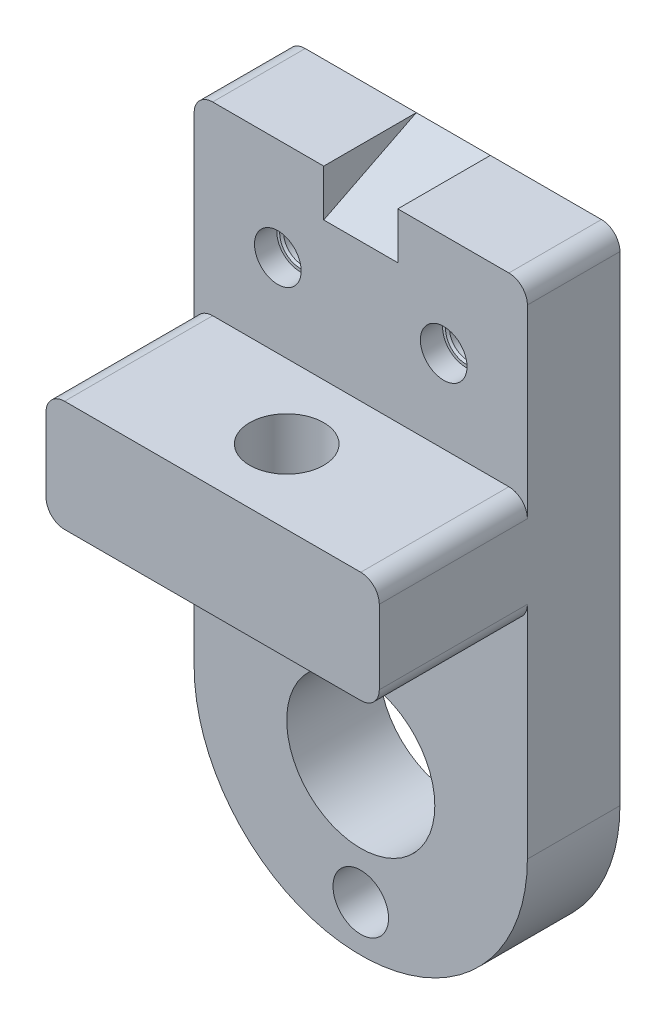
ISO-10303-21;
HEADER;
FILE_DESCRIPTION(('STEP AP214'),'2;1');
FILE_NAME('part.step','',(''),(''),'','','');
FILE_SCHEMA(('AUTOMOTIVE_DESIGN { 1 0 10303 214 1 1 1 1 }'));
ENDSEC;
DATA;
#1=APPLICATION_CONTEXT('core data for automotive mechanical design processes');
#2=APPLICATION_PROTOCOL_DEFINITION('international standard','automotive_design',2000,#1);
#3=PRODUCT_CONTEXT('',#1,'mechanical');
#4=PRODUCT('Part','Part','',(#3));
#5=PRODUCT_RELATED_PRODUCT_CATEGORY('part','',(#4));
#6=PRODUCT_DEFINITION_FORMATION('','',#4);
#7=PRODUCT_DEFINITION_CONTEXT('part definition',#1,'design');
#8=PRODUCT_DEFINITION('design','',#6,#7);
#9=PRODUCT_DEFINITION_SHAPE('','',#8);
#10=(LENGTH_UNIT() NAMED_UNIT(*) SI_UNIT(.MILLI.,.METRE.));
#11=(NAMED_UNIT(*) PLANE_ANGLE_UNIT() SI_UNIT($,.RADIAN.));
#12=(NAMED_UNIT(*) SI_UNIT($,.STERADIAN.) SOLID_ANGLE_UNIT());
#13=UNCERTAINTY_MEASURE_WITH_UNIT(LENGTH_MEASURE(1.E-05),#10,'distance_accuracy_value','');
#14=(GEOMETRIC_REPRESENTATION_CONTEXT(3) GLOBAL_UNCERTAINTY_ASSIGNED_CONTEXT((#13)) GLOBAL_UNIT_ASSIGNED_CONTEXT((#10,
#11,#12)) REPRESENTATION_CONTEXT('',''));
#15=CARTESIAN_POINT('',(0.,0.,0.));
#16=DIRECTION('',(0.,0.,1.));
#17=DIRECTION('',(1.,0.,0.));
#18=AXIS2_PLACEMENT_3D('',#15,#16,#17);
#19=CARTESIAN_POINT('',(12.7,0.,31.75));
#20=DIRECTION('',(1.,0.,0.));
#21=DIRECTION('',(0.,1.,0.));
#22=AXIS2_PLACEMENT_3D('',#19,#20,#21);
#23=PLANE('',#22);
#24=DIRECTION('',(0.,0.450068893368779,-0.892993836049165));
#25=VECTOR('',#24,1.);
#26=CARTESIAN_POINT('',(12.7,154.94,31.75));
#27=LINE('',#26,#25);
#28=CARTESIAN_POINT('',(12.7,154.94,31.75));
#29=VERTEX_POINT('',#28);
#30=CARTESIAN_POINT('',(12.7,170.942,0.));
#31=VERTEX_POINT('',#30);
#32=EDGE_CURVE('E163',#29,#31,#27,.T.);
#33=ORIENTED_EDGE('',*,*,#32,.F.);
#34=DIRECTION('',(0.,-1.,0.));
#35=VECTOR('',#34,1.);
#36=CARTESIAN_POINT('',(12.7,0.,31.75));
#37=LINE('',#36,#35);
#38=CARTESIAN_POINT('',(12.7,170.942,31.75));
#39=VERTEX_POINT('',#38);
#40=EDGE_CURVE('E173',#39,#29,#37,.T.);
#41=ORIENTED_EDGE('',*,*,#40,.F.);
#42=DIRECTION('',(0.,0.,-1.));
#43=VECTOR('',#42,1.);
#44=CARTESIAN_POINT('',(12.7,170.942,31.75));
#45=LINE('',#44,#43);
#46=EDGE_CURVE('E178',#39,#31,#45,.T.);
#47=ORIENTED_EDGE('',*,*,#46,.T.);
#48=EDGE_LOOP('',(#33,#41,#47));
#49=FACE_BOUND('',#48,.T.);
#50=ADVANCED_FACE('F41',(#49),#23,.F.);
#51=CARTESIAN_POINT('',(-12.7,0.,31.75));
#52=DIRECTION('',(1.,0.,0.));
#53=DIRECTION('',(0.,0.,-1.));
#54=AXIS2_PLACEMENT_3D('',#51,#52,#53);
#55=PLANE('',#54);
#56=DIRECTION('',(0.,-1.,0.));
#57=VECTOR('',#56,1.);
#58=CARTESIAN_POINT('',(-12.7,0.,31.75));
#59=LINE('',#58,#57);
#60=CARTESIAN_POINT('',(-12.7,170.942,31.75));
#61=VERTEX_POINT('',#60);
#62=CARTESIAN_POINT('',(-12.7,154.94,31.75));
#63=VERTEX_POINT('',#62);
#64=EDGE_CURVE('E172',#61,#63,#59,.T.);
#65=ORIENTED_EDGE('',*,*,#64,.T.);
#66=DIRECTION('',(0.,-0.450068893368779,0.892993836049165));
#67=VECTOR('',#66,1.);
#68=CARTESIAN_POINT('',(-12.7,154.94,31.75));
#69=LINE('',#68,#67);
#70=CARTESIAN_POINT('',(-12.7,170.942,0.));
#71=VERTEX_POINT('',#70);
#72=EDGE_CURVE('E166',#71,#63,#69,.T.);
#73=ORIENTED_EDGE('',*,*,#72,.F.);
#74=DIRECTION('',(0.,0.,-1.));
#75=VECTOR('',#74,1.);
#76=CARTESIAN_POINT('',(-12.7,170.942,31.75));
#77=LINE('',#76,#75);
#78=EDGE_CURVE('E197',#61,#71,#77,.T.);
#79=ORIENTED_EDGE('',*,*,#78,.F.);
#80=EDGE_LOOP('',(#65,#73,#79));
#81=FACE_BOUND('',#80,.T.);
#82=ADVANCED_FACE('F410',(#81),#55,.T.);
#83=CARTESIAN_POINT('',(0.,170.942,31.75));
#84=DIRECTION('',(0.,1.,0.));
#85=DIRECTION('',(0.,0.,1.));
#86=AXIS2_PLACEMENT_3D('',#83,#84,#85);
#87=PLANE('',#86);
#88=DIRECTION('',(1.,0.,0.));
#89=VECTOR('',#88,1.);
#90=CARTESIAN_POINT('',(0.,170.942,0.));
#91=LINE('',#90,#89);
#92=CARTESIAN_POINT('',(-50.8,170.942,0.));
#93=VERTEX_POINT('',#92);
#94=EDGE_CURVE('E198',#93,#71,#91,.T.);
#95=ORIENTED_EDGE('',*,*,#94,.F.);
#96=DIRECTION('',(0.,0.,-1.));
#97=VECTOR('',#96,1.);
#98=CARTESIAN_POINT('',(-50.8,170.942,31.75));
#99=LINE('',#98,#97);
#100=CARTESIAN_POINT('',(-50.8,170.942,31.75));
#101=VERTEX_POINT('',#100);
#102=EDGE_CURVE('E11',#101,#93,#99,.T.);
#103=ORIENTED_EDGE('',*,*,#102,.F.);
#104=DIRECTION('',(1.,0.,0.));
#105=VECTOR('',#104,1.);
#106=CARTESIAN_POINT('',(0.,170.942,31.75));
#107=LINE('',#106,#105);
#108=EDGE_CURVE('E220',#101,#61,#107,.T.);
#109=ORIENTED_EDGE('',*,*,#108,.T.);
#110=ORIENTED_EDGE('',*,*,#78,.T.);
#111=EDGE_LOOP('',(#95,#103,#109,#110));
#112=FACE_BOUND('',#111,.T.);
#113=ADVANCED_FACE('F43',(#112),#87,.T.);
#114=CARTESIAN_POINT('',(-50.8,164.592,31.75));
#115=DIRECTION('',(0.,0.,-1.));
#116=DIRECTION('',(-1.,0.,0.));
#117=AXIS2_PLACEMENT_3D('',#114,#115,#116);
#118=CYLINDRICAL_SURFACE('',#117,6.35);
#119=CARTESIAN_POINT('',(-50.8,164.592,0.));
#120=DIRECTION('',(0.,0.,1.));
#121=DIRECTION('',(1.,0.,0.));
#122=AXIS2_PLACEMENT_3D('',#119,#120,#121);
#123=CIRCLE('',#122,6.35);
#124=CARTESIAN_POINT('',(-57.15,164.592,0.));
#125=VERTEX_POINT('',#124);
#126=EDGE_CURVE('E202',#93,#125,#123,.T.);
#127=ORIENTED_EDGE('',*,*,#126,.T.);
#128=DIRECTION('',(0.,0.,-1.));
#129=VECTOR('',#128,1.);
#130=CARTESIAN_POINT('',(-57.15,164.592,31.75));
#131=LINE('',#130,#129);
#132=CARTESIAN_POINT('',(-57.15,164.592,31.75));
#133=VERTEX_POINT('',#132);
#134=EDGE_CURVE('E51',#133,#125,#131,.T.);
#135=ORIENTED_EDGE('',*,*,#134,.F.);
#136=CARTESIAN_POINT('',(-50.8,164.592,31.75));
#137=DIRECTION('',(0.,0.,1.));
#138=DIRECTION('',(1.,0.,0.));
#139=AXIS2_PLACEMENT_3D('',#136,#137,#138);
#140=CIRCLE('',#139,6.35);
#141=EDGE_CURVE('E338',#101,#133,#140,.T.);
#142=ORIENTED_EDGE('',*,*,#141,.F.);
#143=ORIENTED_EDGE('',*,*,#102,.T.);
#144=EDGE_LOOP('',(#127,#135,#142,#143));
#145=FACE_BOUND('',#144,.T.);
#146=ADVANCED_FACE('F428',(#145),#118,.T.);
#147=CARTESIAN_POINT('',(-57.15,0.,31.75));
#148=DIRECTION('',(1.,0.,0.));
#149=DIRECTION('',(0.,1.,0.));
#150=AXIS2_PLACEMENT_3D('',#147,#148,#149);
#151=PLANE('',#150);
#152=DIRECTION('',(0.,-1.,0.));
#153=VECTOR('',#152,1.);
#154=CARTESIAN_POINT('',(-57.15,0.,0.));
#155=LINE('',#154,#153);
#156=CARTESIAN_POINT('',(-57.15,0.,0.));
#157=VERTEX_POINT('',#156);
#158=EDGE_CURVE('E206',#125,#157,#155,.T.);
#159=ORIENTED_EDGE('',*,*,#158,.T.);
#160=DIRECTION('',(0.,0.,-1.));
#161=VECTOR('',#160,1.);
#162=CARTESIAN_POINT('',(-57.15,0.,31.75));
#163=LINE('',#162,#161);
#164=CARTESIAN_POINT('',(-57.15,0.,31.75));
#165=VERTEX_POINT('',#164);
#166=EDGE_CURVE('E277',#165,#157,#163,.T.);
#167=ORIENTED_EDGE('',*,*,#166,.F.);
#168=DIRECTION('',(0.,-1.,0.));
#169=VECTOR('',#168,1.);
#170=CARTESIAN_POINT('',(-57.15,0.,31.75));
#171=LINE('',#170,#169);
#172=CARTESIAN_POINT('',(-57.15,75.6920000000001,31.75));
#173=VERTEX_POINT('',#172);
#174=EDGE_CURVE('E374',#173,#165,#171,.T.);
#175=ORIENTED_EDGE('',*,*,#174,.F.);
#176=DIRECTION('',(0.,0.,-1.));
#177=VECTOR('',#176,1.);
#178=CARTESIAN_POINT('',(-57.15,75.6920000000001,82.55));
#179=LINE('',#178,#177);
#180=CARTESIAN_POINT('',(-57.15,75.6920000000001,82.55));
#181=VERTEX_POINT('',#180);
#182=EDGE_CURVE('E58',#181,#173,#179,.T.);
#183=ORIENTED_EDGE('',*,*,#182,.F.);
#184=DIRECTION('',(0.,-1.,0.));
#185=VECTOR('',#184,1.);
#186=CARTESIAN_POINT('',(-57.15,0.,82.55));
#187=LINE('',#186,#185);
#188=CARTESIAN_POINT('',(-57.15,101.092,82.55));
#189=VERTEX_POINT('',#188);
#190=EDGE_CURVE('E292',#189,#181,#187,.T.);
#191=ORIENTED_EDGE('',*,*,#190,.F.);
#192=DIRECTION('',(0.,0.,-1.));
#193=VECTOR('',#192,1.);
#194=CARTESIAN_POINT('',(-57.15,101.092,82.55));
#195=LINE('',#194,#193);
#196=CARTESIAN_POINT('',(-57.15,101.092,31.75));
#197=VERTEX_POINT('',#196);
#198=EDGE_CURVE('E325',#189,#197,#195,.T.);
#199=ORIENTED_EDGE('',*,*,#198,.T.);
#200=DIRECTION('',(0.,-1.,0.));
#201=VECTOR('',#200,1.);
#202=CARTESIAN_POINT('',(-57.15,0.,31.75));
#203=LINE('',#202,#201);
#204=EDGE_CURVE('E242',#133,#197,#203,.T.);
#205=ORIENTED_EDGE('',*,*,#204,.F.);
#206=ORIENTED_EDGE('',*,*,#134,.T.);
#207=EDGE_LOOP('',(#159,#167,#175,#183,#191,#199,#205,#206));
#208=FACE_BOUND('',#207,.T.);
#209=ADVANCED_FACE('F238',(#208),#151,.F.);
#210=CARTESIAN_POINT('',(57.15,0.,31.75));
#211=DIRECTION('',(1.,0.,0.));
#212=DIRECTION('',(0.,1.,0.));
#213=AXIS2_PLACEMENT_3D('',#210,#211,#212);
#214=PLANE('',#213);
#215=DIRECTION('',(0.,-1.,0.));
#216=VECTOR('',#215,1.);
#217=CARTESIAN_POINT('',(57.15,0.,0.));
#218=LINE('',#217,#216);
#219=CARTESIAN_POINT('',(57.15,164.592,0.));
#220=VERTEX_POINT('',#219);
#221=CARTESIAN_POINT('',(57.15,0.,0.));
#222=VERTEX_POINT('',#221);
#223=EDGE_CURVE('E209',#220,#222,#218,.T.);
#224=ORIENTED_EDGE('',*,*,#223,.F.);
#225=DIRECTION('',(0.,0.,-1.));
#226=VECTOR('',#225,1.);
#227=CARTESIAN_POINT('',(57.15,164.592,31.75));
#228=LINE('',#227,#226);
#229=CARTESIAN_POINT('',(57.15,164.592,31.75));
#230=VERTEX_POINT('',#229);
#231=EDGE_CURVE('E229',#230,#220,#228,.T.);
#232=ORIENTED_EDGE('',*,*,#231,.F.);
#233=DIRECTION('',(0.,-1.,0.));
#234=VECTOR('',#233,1.);
#235=CARTESIAN_POINT('',(57.15,0.,31.75));
#236=LINE('',#235,#234);
#237=CARTESIAN_POINT('',(57.15,101.092,31.75));
#238=VERTEX_POINT('',#237);
#239=EDGE_CURVE('E352',#230,#238,#236,.T.);
#240=ORIENTED_EDGE('',*,*,#239,.T.);
#241=DIRECTION('',(0.,0.,-1.));
#242=VECTOR('',#241,1.);
#243=CARTESIAN_POINT('',(57.15,101.092,82.55));
#244=LINE('',#243,#242);
#245=CARTESIAN_POINT('',(57.15,101.092,82.55));
#246=VERTEX_POINT('',#245);
#247=EDGE_CURVE('E308',#246,#238,#244,.T.);
#248=ORIENTED_EDGE('',*,*,#247,.F.);
#249=DIRECTION('',(0.,-1.,0.));
#250=VECTOR('',#249,1.);
#251=CARTESIAN_POINT('',(57.15,0.,82.55));
#252=LINE('',#251,#250);
#253=CARTESIAN_POINT('',(57.15,75.6920000000001,82.55));
#254=VERTEX_POINT('',#253);
#255=EDGE_CURVE('E304',#246,#254,#252,.T.);
#256=ORIENTED_EDGE('',*,*,#255,.T.);
#257=DIRECTION('',(0.,0.,-1.));
#258=VECTOR('',#257,1.);
#259=CARTESIAN_POINT('',(57.15,75.6920000000001,82.55));
#260=LINE('',#259,#258);
#261=CARTESIAN_POINT('',(57.15,75.6920000000001,31.75));
#262=VERTEX_POINT('',#261);
#263=EDGE_CURVE('E312',#254,#262,#260,.T.);
#264=ORIENTED_EDGE('',*,*,#263,.T.);
#265=DIRECTION('',(0.,-1.,0.));
#266=VECTOR('',#265,1.);
#267=CARTESIAN_POINT('',(57.15,0.,31.75));
#268=LINE('',#267,#266);
#269=CARTESIAN_POINT('',(57.15,0.,31.75));
#270=VERTEX_POINT('',#269);
#271=EDGE_CURVE('E380',#262,#270,#268,.T.);
#272=ORIENTED_EDGE('',*,*,#271,.T.);
#273=DIRECTION('',(0.,0.,-1.));
#274=VECTOR('',#273,1.);
#275=CARTESIAN_POINT('',(57.15,0.,31.75));
#276=LINE('',#275,#274);
#277=EDGE_CURVE('E274',#270,#222,#276,.T.);
#278=ORIENTED_EDGE('',*,*,#277,.T.);
#279=EDGE_LOOP('',(#224,#232,#240,#248,#256,#264,#272,#278));
#280=FACE_BOUND('',#279,.T.);
#281=ADVANCED_FACE('F423',(#280),#214,.T.);
#282=CARTESIAN_POINT('',(50.8,164.592,31.75));
#283=DIRECTION('',(0.,0.,-1.));
#284=DIRECTION('',(-1.,0.,0.));
#285=AXIS2_PLACEMENT_3D('',#282,#283,#284);
#286=CYLINDRICAL_SURFACE('',#285,6.35);
#287=CARTESIAN_POINT('',(50.8,164.592,0.));
#288=DIRECTION('',(0.,0.,1.));
#289=DIRECTION('',(1.,0.,0.));
#290=AXIS2_PLACEMENT_3D('',#287,#288,#289);
#291=CIRCLE('',#290,6.35);
#292=CARTESIAN_POINT('',(50.8,170.942,0.));
#293=VERTEX_POINT('',#292);
#294=EDGE_CURVE('E212',#293,#220,#291,.F.);
#295=ORIENTED_EDGE('',*,*,#294,.F.);
#296=DIRECTION('',(0.,0.,-1.));
#297=VECTOR('',#296,1.);
#298=CARTESIAN_POINT('',(50.8,170.942,31.75));
#299=LINE('',#298,#297);
#300=CARTESIAN_POINT('',(50.8,170.942,31.75));
#301=VERTEX_POINT('',#300);
#302=EDGE_CURVE('E226',#301,#293,#299,.T.);
#303=ORIENTED_EDGE('',*,*,#302,.F.);
#304=CARTESIAN_POINT('',(50.8,164.592,31.75));
#305=DIRECTION('',(0.,0.,1.));
#306=DIRECTION('',(1.,0.,0.));
#307=AXIS2_PLACEMENT_3D('',#304,#305,#306);
#308=CIRCLE('',#307,6.35);
#309=EDGE_CURVE('E191',#301,#230,#308,.F.);
#310=ORIENTED_EDGE('',*,*,#309,.T.);
#311=ORIENTED_EDGE('',*,*,#231,.T.);
#312=EDGE_LOOP('',(#295,#303,#310,#311));
#313=FACE_BOUND('',#312,.T.);
#314=ADVANCED_FACE('F359',(#313),#286,.T.);
#315=CARTESIAN_POINT('',(0.,170.942,31.75));
#316=DIRECTION('',(0.,1.,0.));
#317=DIRECTION('',(0.,0.,1.));
#318=AXIS2_PLACEMENT_3D('',#315,#316,#317);
#319=PLANE('',#318);
#320=DIRECTION('',(1.,0.,0.));
#321=VECTOR('',#320,1.);
#322=CARTESIAN_POINT('',(0.,170.942,0.));
#323=LINE('',#322,#321);
#324=EDGE_CURVE('E216',#31,#293,#323,.T.);
#325=ORIENTED_EDGE('',*,*,#324,.F.);
#326=ORIENTED_EDGE('',*,*,#46,.F.);
#327=DIRECTION('',(1.,0.,0.));
#328=VECTOR('',#327,1.);
#329=CARTESIAN_POINT('',(0.,170.942,31.75));
#330=LINE('',#329,#328);
#331=EDGE_CURVE('E187',#39,#301,#330,.T.);
#332=ORIENTED_EDGE('',*,*,#331,.T.);
#333=ORIENTED_EDGE('',*,*,#302,.T.);
#334=EDGE_LOOP('',(#325,#326,#332,#333));
#335=FACE_BOUND('',#334,.T.);
#336=ADVANCED_FACE('F362',(#335),#319,.T.);
#337=CARTESIAN_POINT('',(0.,0.,31.75));
#338=DIRECTION('',(0.,0.,1.));
#339=DIRECTION('',(1.,0.,0.));
#340=AXIS2_PLACEMENT_3D('',#337,#338,#339);
#341=PLANE('',#340);
#342=CARTESIAN_POINT('',(28.448,135.89,31.75));
#343=DIRECTION('',(0.,0.,1.));
#344=DIRECTION('',(1.,0.,0.));
#345=AXIS2_PLACEMENT_3D('',#342,#343,#344);
#346=CIRCLE('',#345,8.00099999999999);
#347=CARTESIAN_POINT('',(36.449,135.89,31.75));
#348=VERTEX_POINT('',#347);
#349=EDGE_CURVE('E555',#348,#348,#346,.T.);
#350=ORIENTED_EDGE('',*,*,#349,.F.);
#351=EDGE_LOOP('',(#350));
#352=FACE_BOUND('',#351,.T.);
#353=CARTESIAN_POINT('',(-28.448,135.89,31.75));
#354=DIRECTION('',(0.,0.,1.));
#355=DIRECTION('',(1.,0.,0.));
#356=AXIS2_PLACEMENT_3D('',#353,#354,#355);
#357=CIRCLE('',#356,8.00099999999999);
#358=CARTESIAN_POINT('',(-20.447,135.89,31.75));
#359=VERTEX_POINT('',#358);
#360=EDGE_CURVE('E537',#359,#359,#357,.T.);
#361=ORIENTED_EDGE('',*,*,#360,.F.);
#362=EDGE_LOOP('',(#361));
#363=FACE_BOUND('',#362,.T.);
#364=ORIENTED_EDGE('',*,*,#108,.F.);
#365=ORIENTED_EDGE('',*,*,#141,.T.);
#366=ORIENTED_EDGE('',*,*,#204,.T.);
#367=CARTESIAN_POINT('',(-50.8,101.092,31.75));
#368=DIRECTION('',(0.,0.,1.));
#369=DIRECTION('',(1.,0.,0.));
#370=AXIS2_PLACEMENT_3D('',#367,#368,#369);
#371=CIRCLE('',#370,6.34999999999999);
#372=CARTESIAN_POINT('',(-50.8,107.442,31.75));
#373=VERTEX_POINT('',#372);
#374=EDGE_CURVE('E343',#197,#373,#371,.F.);
#375=ORIENTED_EDGE('',*,*,#374,.T.);
#376=DIRECTION('',(1.,0.,0.));
#377=VECTOR('',#376,1.);
#378=CARTESIAN_POINT('',(0.,107.442,31.75));
#379=LINE('',#378,#377);
#380=CARTESIAN_POINT('',(50.8,107.442,31.75));
#381=VERTEX_POINT('',#380);
#382=EDGE_CURVE('E346',#373,#381,#379,.T.);
#383=ORIENTED_EDGE('',*,*,#382,.T.);
#384=CARTESIAN_POINT('',(50.8,101.092,31.75));
#385=DIRECTION('',(0.,0.,1.));
#386=DIRECTION('',(1.,0.,0.));
#387=AXIS2_PLACEMENT_3D('',#384,#385,#386);
#388=CIRCLE('',#387,6.34999999999999);
#389=EDGE_CURVE('E349',#381,#238,#388,.F.);
#390=ORIENTED_EDGE('',*,*,#389,.T.);
#391=ORIENTED_EDGE('',*,*,#239,.F.);
#392=ORIENTED_EDGE('',*,*,#309,.F.);
#393=ORIENTED_EDGE('',*,*,#331,.F.);
#394=ORIENTED_EDGE('',*,*,#40,.T.);
#395=DIRECTION('',(1.,0.,0.));
#396=VECTOR('',#395,1.);
#397=CARTESIAN_POINT('',(0.,154.94,31.75));
#398=LINE('',#397,#396);
#399=EDGE_CURVE('E160',#63,#29,#398,.T.);
#400=ORIENTED_EDGE('',*,*,#399,.F.);
#401=ORIENTED_EDGE('',*,*,#64,.F.);
#402=EDGE_LOOP('',(#364,#365,#366,#375,#383,#390,#391,#392,#393,#394,#400,#401));
#403=FACE_BOUND('',#402,.T.);
#404=ADVANCED_FACE('F184',(#352,#363,#403),#341,.T.);
#405=CARTESIAN_POINT('',(0.,0.,0.));
#406=DIRECTION('',(0.,0.,1.));
#407=DIRECTION('',(1.,0.,0.));
#408=AXIS2_PLACEMENT_3D('',#405,#406,#407);
#409=PLANE('',#408);
#410=CARTESIAN_POINT('',(28.448,135.89,0.));
#411=DIRECTION('',(0.,0.,1.));
#412=DIRECTION('',(1.,0.,0.));
#413=AXIS2_PLACEMENT_3D('',#410,#411,#412);
#414=CIRCLE('',#413,6.34999999999999);
#415=CARTESIAN_POINT('',(34.798,135.89,0.));
#416=VERTEX_POINT('',#415);
#417=EDGE_CURVE('E492',#416,#416,#414,.T.);
#418=ORIENTED_EDGE('',*,*,#417,.T.);
#419=EDGE_LOOP('',(#418));
#420=FACE_BOUND('',#419,.T.);
#421=CARTESIAN_POINT('',(-28.448,135.89,0.));
#422=DIRECTION('',(0.,0.,1.));
#423=DIRECTION('',(1.,0.,0.));
#424=AXIS2_PLACEMENT_3D('',#421,#422,#423);
#425=CIRCLE('',#424,6.34999999999999);
#426=CARTESIAN_POINT('',(-22.098,135.89,0.));
#427=VERTEX_POINT('',#426);
#428=EDGE_CURVE('E496',#427,#427,#425,.T.);
#429=ORIENTED_EDGE('',*,*,#428,.T.);
#430=EDGE_LOOP('',(#429));
#431=FACE_BOUND('',#430,.T.);
#432=CARTESIAN_POINT('',(-28.702,41.402,0.));
#433=DIRECTION('',(0.,0.,1.));
#434=DIRECTION('',(1.,0.,0.));
#435=AXIS2_PLACEMENT_3D('',#432,#433,#434);
#436=CIRCLE('',#435,6.34999999999999);
#437=CARTESIAN_POINT('',(-22.352,41.402,0.));
#438=VERTEX_POINT('',#437);
#439=EDGE_CURVE('E499',#438,#438,#436,.T.);
#440=ORIENTED_EDGE('',*,*,#439,.T.);
#441=EDGE_LOOP('',(#440));
#442=FACE_BOUND('',#441,.T.);
#443=CARTESIAN_POINT('',(0.,0.,0.));
#444=DIRECTION('',(0.,0.,1.));
#445=DIRECTION('',(1.,0.,0.));
#446=AXIS2_PLACEMENT_3D('',#443,#444,#445);
#447=CIRCLE('',#446,57.15);
#448=EDGE_CURVE('E252',#157,#222,#447,.T.);
#449=ORIENTED_EDGE('',*,*,#448,.F.);
#450=ORIENTED_EDGE('',*,*,#158,.F.);
#451=ORIENTED_EDGE('',*,*,#126,.F.);
#452=ORIENTED_EDGE('',*,*,#94,.T.);
#453=DIRECTION('',(1.,0.,0.));
#454=VECTOR('',#453,1.);
#455=CARTESIAN_POINT('',(-57.152,170.942,0.));
#456=LINE('',#455,#454);
#457=EDGE_CURVE('E181',#71,#31,#456,.T.);
#458=ORIENTED_EDGE('',*,*,#457,.T.);
#459=ORIENTED_EDGE('',*,*,#324,.T.);
#460=ORIENTED_EDGE('',*,*,#294,.T.);
#461=ORIENTED_EDGE('',*,*,#223,.T.);
#462=EDGE_LOOP('',(#449,#450,#451,#452,#458,#459,#460,#461));
#463=FACE_BOUND('',#462,.T.);
#464=CARTESIAN_POINT('',(0.,-41.402,0.));
#465=DIRECTION('',(0.,0.,1.));
#466=DIRECTION('',(1.,0.,0.));
#467=AXIS2_PLACEMENT_3D('',#464,#465,#466);
#468=CIRCLE('',#467,9.525);
#469=CARTESIAN_POINT('',(9.525,-41.402,0.));
#470=VERTEX_POINT('',#469);
#471=EDGE_CURVE('E258',#470,#470,#468,.T.);
#472=ORIENTED_EDGE('',*,*,#471,.T.);
#473=EDGE_LOOP('',(#472));
#474=FACE_BOUND('',#473,.T.);
#475=CARTESIAN_POINT('',(0.,0.,0.));
#476=DIRECTION('',(0.,0.,1.));
#477=DIRECTION('',(1.,0.,0.));
#478=AXIS2_PLACEMENT_3D('',#475,#476,#477);
#479=CIRCLE('',#478,25.4);
#480=CARTESIAN_POINT('',(25.4,0.,0.));
#481=VERTEX_POINT('',#480);
#482=EDGE_CURVE('E263',#481,#481,#479,.T.);
#483=ORIENTED_EDGE('',*,*,#482,.T.);
#484=EDGE_LOOP('',(#483));
#485=FACE_BOUND('',#484,.T.);
#486=ADVANCED_FACE('F248',(#420,#431,#442,#463,#474,#485),#409,.F.);
#487=CARTESIAN_POINT('',(50.8,101.092,82.55));
#488=DIRECTION('',(0.,0.,-1.));
#489=DIRECTION('',(-1.,0.,0.));
#490=AXIS2_PLACEMENT_3D('',#487,#488,#489);
#491=CYLINDRICAL_SURFACE('',#490,6.34999999999999);
#492=ORIENTED_EDGE('',*,*,#247,.T.);
#493=ORIENTED_EDGE('',*,*,#389,.F.);
#494=DIRECTION('',(0.,0.,-1.));
#495=VECTOR('',#494,1.);
#496=CARTESIAN_POINT('',(50.8,107.442,82.55));
#497=LINE('',#496,#495);
#498=CARTESIAN_POINT('',(50.8,107.442,82.55));
#499=VERTEX_POINT('',#498);
#500=EDGE_CURVE('E203',#499,#381,#497,.T.);
#501=ORIENTED_EDGE('',*,*,#500,.F.);
#502=CARTESIAN_POINT('',(50.8,101.092,82.55));
#503=DIRECTION('',(0.,0.,1.));
#504=DIRECTION('',(1.,0.,0.));
#505=AXIS2_PLACEMENT_3D('',#502,#503,#504);
#506=CIRCLE('',#505,6.34999999999999);
#507=EDGE_CURVE('E280',#499,#246,#506,.F.);
#508=ORIENTED_EDGE('',*,*,#507,.T.);
#509=EDGE_LOOP('',(#492,#493,#501,#508));
#510=FACE_BOUND('',#509,.T.);
#511=ADVANCED_FACE('F451',(#510),#491,.T.);
#512=CARTESIAN_POINT('',(0.,107.442,82.55));
#513=DIRECTION('',(0.,1.,0.));
#514=DIRECTION('',(0.,0.,1.));
#515=AXIS2_PLACEMENT_3D('',#512,#513,#514);
#516=PLANE('',#515);
#517=CARTESIAN_POINT('',(0.,107.442,57.15));
#518=DIRECTION('',(0.,1.,0.));
#519=DIRECTION('',(0.,0.,1.));
#520=AXIS2_PLACEMENT_3D('',#517,#518,#519);
#521=CIRCLE('',#520,12.7);
#522=CARTESIAN_POINT('',(0.,107.442,69.85));
#523=VERTEX_POINT('',#522);
#524=EDGE_CURVE('E502',#523,#523,#521,.T.);
#525=ORIENTED_EDGE('',*,*,#524,.F.);
#526=EDGE_LOOP('',(#525));
#527=FACE_BOUND('',#526,.T.);
#528=ORIENTED_EDGE('',*,*,#500,.T.);
#529=ORIENTED_EDGE('',*,*,#382,.F.);
#530=DIRECTION('',(0.,0.,-1.));
#531=VECTOR('',#530,1.);
#532=CARTESIAN_POINT('',(-50.8,107.442,82.55));
#533=LINE('',#532,#531);
#534=CARTESIAN_POINT('',(-50.8,107.442,82.55));
#535=VERTEX_POINT('',#534);
#536=EDGE_CURVE('E328',#535,#373,#533,.T.);
#537=ORIENTED_EDGE('',*,*,#536,.F.);
#538=DIRECTION('',(1.,0.,0.));
#539=VECTOR('',#538,1.);
#540=CARTESIAN_POINT('',(0.,107.442,82.55));
#541=LINE('',#540,#539);
#542=EDGE_CURVE('E284',#535,#499,#541,.T.);
#543=ORIENTED_EDGE('',*,*,#542,.T.);
#544=EDGE_LOOP('',(#528,#529,#537,#543));
#545=FACE_BOUND('',#544,.T.);
#546=ADVANCED_FACE('F448',(#527,#545),#516,.T.);
#547=CARTESIAN_POINT('',(-50.8,101.092,82.55));
#548=DIRECTION('',(0.,0.,-1.));
#549=DIRECTION('',(-1.,0.,0.));
#550=AXIS2_PLACEMENT_3D('',#547,#548,#549);
#551=CYLINDRICAL_SURFACE('',#550,6.34999999999999);
#552=ORIENTED_EDGE('',*,*,#536,.T.);
#553=ORIENTED_EDGE('',*,*,#374,.F.);
#554=ORIENTED_EDGE('',*,*,#198,.F.);
#555=CARTESIAN_POINT('',(-50.8,101.092,82.55));
#556=DIRECTION('',(0.,0.,1.));
#557=DIRECTION('',(1.,0.,0.));
#558=AXIS2_PLACEMENT_3D('',#555,#556,#557);
#559=CIRCLE('',#558,6.34999999999999);
#560=EDGE_CURVE('E288',#189,#535,#559,.F.);
#561=ORIENTED_EDGE('',*,*,#560,.T.);
#562=EDGE_LOOP('',(#552,#553,#554,#561));
#563=FACE_BOUND('',#562,.T.);
#564=ADVANCED_FACE('F437',(#563),#551,.T.);
#565=CARTESIAN_POINT('',(-50.8,75.692,82.55));
#566=DIRECTION('',(0.,0.,-1.));
#567=DIRECTION('',(-1.,0.,0.));
#568=AXIS2_PLACEMENT_3D('',#565,#566,#567);
#569=CYLINDRICAL_SURFACE('',#568,6.34999999999999);
#570=CARTESIAN_POINT('',(-50.8,75.692,31.75));
#571=DIRECTION('',(0.,0.,1.));
#572=DIRECTION('',(1.,0.,0.));
#573=AXIS2_PLACEMENT_3D('',#570,#571,#572);
#574=CIRCLE('',#573,6.34999999999999);
#575=CARTESIAN_POINT('',(-50.8,69.342,31.75));
#576=VERTEX_POINT('',#575);
#577=EDGE_CURVE('E62',#576,#173,#574,.F.);
#578=ORIENTED_EDGE('',*,*,#577,.F.);
#579=DIRECTION('',(0.,0.,-1.));
#580=VECTOR('',#579,1.);
#581=CARTESIAN_POINT('',(-50.8,69.342,82.55));
#582=LINE('',#581,#580);
#583=CARTESIAN_POINT('',(-50.8,69.342,82.55));
#584=VERTEX_POINT('',#583);
#585=EDGE_CURVE('E320',#584,#576,#582,.T.);
#586=ORIENTED_EDGE('',*,*,#585,.F.);
#587=CARTESIAN_POINT('',(-50.8,75.692,82.55));
#588=DIRECTION('',(0.,0.,1.));
#589=DIRECTION('',(1.,0.,0.));
#590=AXIS2_PLACEMENT_3D('',#587,#588,#589);
#591=CIRCLE('',#590,6.34999999999999);
#592=EDGE_CURVE('E295',#584,#181,#591,.F.);
#593=ORIENTED_EDGE('',*,*,#592,.T.);
#594=ORIENTED_EDGE('',*,*,#182,.T.);
#595=EDGE_LOOP('',(#578,#586,#593,#594));
#596=FACE_BOUND('',#595,.T.);
#597=ADVANCED_FACE('F466',(#596),#569,.T.);
#598=CARTESIAN_POINT('',(0.,69.342,82.55));
#599=DIRECTION('',(0.,1.,0.));
#600=DIRECTION('',(0.,0.,1.));
#601=AXIS2_PLACEMENT_3D('',#598,#599,#600);
#602=PLANE('',#601);
#603=CARTESIAN_POINT('',(0.,69.342,57.15));
#604=DIRECTION('',(0.,1.,0.));
#605=DIRECTION('',(0.,0.,1.));
#606=AXIS2_PLACEMENT_3D('',#603,#604,#605);
#607=CIRCLE('',#606,12.7);
#608=CARTESIAN_POINT('',(0.,69.342,69.85));
#609=VERTEX_POINT('',#608);
#610=EDGE_CURVE('E45',#609,#609,#607,.T.);
#611=ORIENTED_EDGE('',*,*,#610,.T.);
#612=EDGE_LOOP('',(#611));
#613=FACE_BOUND('',#612,.T.);
#614=ORIENTED_EDGE('',*,*,#585,.T.);
#615=DIRECTION('',(1.,0.,0.));
#616=VECTOR('',#615,1.);
#617=CARTESIAN_POINT('',(0.,69.342,31.75));
#618=LINE('',#617,#616);
#619=CARTESIAN_POINT('',(50.8,69.342,31.75));
#620=VERTEX_POINT('',#619);
#621=EDGE_CURVE('E369',#576,#620,#618,.T.);
#622=ORIENTED_EDGE('',*,*,#621,.T.);
#623=DIRECTION('',(0.,0.,-1.));
#624=VECTOR('',#623,1.);
#625=CARTESIAN_POINT('',(50.8,69.342,82.55));
#626=LINE('',#625,#624);
#627=CARTESIAN_POINT('',(50.8,69.342,82.55));
#628=VERTEX_POINT('',#627);
#629=EDGE_CURVE('E316',#628,#620,#626,.T.);
#630=ORIENTED_EDGE('',*,*,#629,.F.);
#631=DIRECTION('',(1.,0.,0.));
#632=VECTOR('',#631,1.);
#633=CARTESIAN_POINT('',(0.,69.342,82.55));
#634=LINE('',#633,#632);
#635=EDGE_CURVE('E298',#584,#628,#634,.T.);
#636=ORIENTED_EDGE('',*,*,#635,.F.);
#637=EDGE_LOOP('',(#614,#622,#630,#636));
#638=FACE_BOUND('',#637,.T.);
#639=ADVANCED_FACE('F460',(#613,#638),#602,.F.);
#640=CARTESIAN_POINT('',(50.8,75.692,82.55));
#641=DIRECTION('',(0.,0.,-1.));
#642=DIRECTION('',(-1.,0.,0.));
#643=AXIS2_PLACEMENT_3D('',#640,#641,#642);
#644=CYLINDRICAL_SURFACE('',#643,6.34999999999999);
#645=ORIENTED_EDGE('',*,*,#629,.T.);
#646=CARTESIAN_POINT('',(50.8,75.692,31.75));
#647=DIRECTION('',(0.,0.,1.));
#648=DIRECTION('',(1.,0.,0.));
#649=AXIS2_PLACEMENT_3D('',#646,#647,#648);
#650=CIRCLE('',#649,6.34999999999999);
#651=EDGE_CURVE('E273',#620,#262,#650,.T.);
#652=ORIENTED_EDGE('',*,*,#651,.T.);
#653=ORIENTED_EDGE('',*,*,#263,.F.);
#654=CARTESIAN_POINT('',(50.8,75.692,82.55));
#655=DIRECTION('',(0.,0.,1.));
#656=DIRECTION('',(1.,0.,0.));
#657=AXIS2_PLACEMENT_3D('',#654,#655,#656);
#658=CIRCLE('',#657,6.34999999999999);
#659=EDGE_CURVE('E301',#628,#254,#658,.T.);
#660=ORIENTED_EDGE('',*,*,#659,.F.);
#661=EDGE_LOOP('',(#645,#652,#653,#660));
#662=FACE_BOUND('',#661,.T.);
#663=ADVANCED_FACE('F464',(#662),#644,.T.);
#664=CARTESIAN_POINT('',(0.,0.,82.55));
#665=DIRECTION('',(0.,0.,1.));
#666=DIRECTION('',(1.,0.,0.));
#667=AXIS2_PLACEMENT_3D('',#664,#665,#666);
#668=PLANE('',#667);
#669=ORIENTED_EDGE('',*,*,#507,.F.);
#670=ORIENTED_EDGE('',*,*,#542,.F.);
#671=ORIENTED_EDGE('',*,*,#560,.F.);
#672=ORIENTED_EDGE('',*,*,#190,.T.);
#673=ORIENTED_EDGE('',*,*,#592,.F.);
#674=ORIENTED_EDGE('',*,*,#635,.T.);
#675=ORIENTED_EDGE('',*,*,#659,.T.);
#676=ORIENTED_EDGE('',*,*,#255,.F.);
#677=EDGE_LOOP('',(#669,#670,#671,#672,#673,#674,#675,#676));
#678=FACE_BOUND('',#677,.T.);
#679=ADVANCED_FACE('F445',(#678),#668,.T.);
#680=CARTESIAN_POINT('',(0.,0.,31.75));
#681=DIRECTION('',(0.,0.,-1.));
#682=DIRECTION('',(-1.,0.,0.));
#683=AXIS2_PLACEMENT_3D('',#680,#681,#682);
#684=CYLINDRICAL_SURFACE('',#683,57.15);
#685=ORIENTED_EDGE('',*,*,#448,.T.);
#686=ORIENTED_EDGE('',*,*,#277,.F.);
#687=CARTESIAN_POINT('',(0.,0.,31.75));
#688=DIRECTION('',(0.,0.,1.));
#689=DIRECTION('',(1.,0.,0.));
#690=AXIS2_PLACEMENT_3D('',#687,#688,#689);
#691=CIRCLE('',#690,57.15);
#692=EDGE_CURVE('E377',#165,#270,#691,.T.);
#693=ORIENTED_EDGE('',*,*,#692,.F.);
#694=ORIENTED_EDGE('',*,*,#166,.T.);
#695=EDGE_LOOP('',(#685,#686,#693,#694));
#696=FACE_BOUND('',#695,.T.);
#697=ADVANCED_FACE('F454',(#696),#684,.T.);
#698=CARTESIAN_POINT('',(0.,-41.402,31.75));
#699=DIRECTION('',(0.,0.,-1.));
#700=DIRECTION('',(-1.,0.,0.));
#701=AXIS2_PLACEMENT_3D('',#698,#699,#700);
#702=CYLINDRICAL_SURFACE('',#701,9.525);
#703=CARTESIAN_POINT('',(0.,-41.402,31.75));
#704=DIRECTION('',(0.,0.,1.));
#705=DIRECTION('',(1.,0.,0.));
#706=AXIS2_PLACEMENT_3D('',#703,#704,#705);
#707=CIRCLE('',#706,9.525);
#708=CARTESIAN_POINT('',(9.525,-41.402,31.75));
#709=VERTEX_POINT('',#708);
#710=EDGE_CURVE('E383',#709,#709,#707,.T.);
#711=ORIENTED_EDGE('',*,*,#710,.T.);
#712=EDGE_LOOP('',(#711));
#713=FACE_BOUND('',#712,.T.);
#714=ORIENTED_EDGE('',*,*,#471,.F.);
#715=EDGE_LOOP('',(#714));
#716=FACE_BOUND('',#715,.T.);
#717=ADVANCED_FACE('F405',(#713,#716),#702,.F.);
#718=CARTESIAN_POINT('',(0.,0.,31.75));
#719=DIRECTION('',(0.,0.,-1.));
#720=DIRECTION('',(-1.,0.,0.));
#721=AXIS2_PLACEMENT_3D('',#718,#719,#720);
#722=CYLINDRICAL_SURFACE('',#721,25.4);
#723=CARTESIAN_POINT('',(0.,0.,31.75));
#724=DIRECTION('',(0.,0.,1.));
#725=DIRECTION('',(1.,0.,0.));
#726=AXIS2_PLACEMENT_3D('',#723,#724,#725);
#727=CIRCLE('',#726,25.4);
#728=CARTESIAN_POINT('',(25.4,0.,31.75));
#729=VERTEX_POINT('',#728);
#730=EDGE_CURVE('E267',#729,#729,#727,.T.);
#731=ORIENTED_EDGE('',*,*,#730,.T.);
#732=EDGE_LOOP('',(#731));
#733=FACE_BOUND('',#732,.T.);
#734=ORIENTED_EDGE('',*,*,#482,.F.);
#735=EDGE_LOOP('',(#734));
#736=FACE_BOUND('',#735,.T.);
#737=ADVANCED_FACE('F392',(#733,#736),#722,.F.);
#738=CARTESIAN_POINT('',(0.,0.,31.75));
#739=DIRECTION('',(0.,0.,1.));
#740=DIRECTION('',(1.,0.,0.));
#741=AXIS2_PLACEMENT_3D('',#738,#739,#740);
#742=PLANE('',#741);
#743=CARTESIAN_POINT('',(-28.702,41.402,31.75));
#744=DIRECTION('',(0.,0.,1.));
#745=DIRECTION('',(1.,0.,0.));
#746=AXIS2_PLACEMENT_3D('',#743,#744,#745);
#747=CIRCLE('',#746,8.00099999999999);
#748=CARTESIAN_POINT('',(-20.701,41.402,31.75));
#749=VERTEX_POINT('',#748);
#750=EDGE_CURVE('E519',#749,#749,#747,.T.);
#751=ORIENTED_EDGE('',*,*,#750,.F.);
#752=EDGE_LOOP('',(#751));
#753=FACE_BOUND('',#752,.T.);
#754=ORIENTED_EDGE('',*,*,#651,.F.);
#755=ORIENTED_EDGE('',*,*,#621,.F.);
#756=ORIENTED_EDGE('',*,*,#577,.T.);
#757=ORIENTED_EDGE('',*,*,#174,.T.);
#758=ORIENTED_EDGE('',*,*,#692,.T.);
#759=ORIENTED_EDGE('',*,*,#271,.F.);
#760=EDGE_LOOP('',(#754,#755,#756,#757,#758,#759));
#761=FACE_BOUND('',#760,.T.);
#762=ORIENTED_EDGE('',*,*,#710,.F.);
#763=EDGE_LOOP('',(#762));
#764=FACE_BOUND('',#763,.T.);
#765=ORIENTED_EDGE('',*,*,#730,.F.);
#766=EDGE_LOOP('',(#765));
#767=FACE_BOUND('',#766,.T.);
#768=ADVANCED_FACE('F395',(#753,#761,#764,#767),#742,.T.);
#769=CARTESIAN_POINT('',(-57.152,154.94,31.75));
#770=DIRECTION('',(0.,-0.892993836049165,-0.450068893368779));
#771=DIRECTION('',(0.,0.450068893368779,-0.892993836049165));
#772=AXIS2_PLACEMENT_3D('',#769,#770,#771);
#773=PLANE('',#772);
#774=ORIENTED_EDGE('',*,*,#457,.F.);
#775=ORIENTED_EDGE('',*,*,#72,.T.);
#776=ORIENTED_EDGE('',*,*,#399,.T.);
#777=ORIENTED_EDGE('',*,*,#32,.T.);
#778=EDGE_LOOP('',(#774,#775,#776,#777));
#779=FACE_BOUND('',#778,.T.);
#780=ADVANCED_FACE('F162',(#779),#773,.F.);
#781=CARTESIAN_POINT('',(0.,107.442,57.15));
#782=DIRECTION('',(0.,1.,0.));
#783=DIRECTION('',(0.,0.,1.));
#784=AXIS2_PLACEMENT_3D('',#781,#782,#783);
#785=CYLINDRICAL_SURFACE('',#784,12.7);
#786=ORIENTED_EDGE('',*,*,#524,.T.);
#787=EDGE_LOOP('',(#786));
#788=FACE_BOUND('',#787,.T.);
#789=ORIENTED_EDGE('',*,*,#610,.F.);
#790=EDGE_LOOP('',(#789));
#791=FACE_BOUND('',#790,.T.);
#792=ADVANCED_FACE('F403',(#788,#791),#785,.F.);
#793=CARTESIAN_POINT('',(-28.702,41.402,31.75));
#794=DIRECTION('',(0.,0.,1.));
#795=DIRECTION('',(1.,0.,0.));
#796=AXIS2_PLACEMENT_3D('',#793,#794,#795);
#797=CYLINDRICAL_SURFACE('',#796,6.34999999999999);
#798=ORIENTED_EDGE('',*,*,#439,.F.);
#799=EDGE_LOOP('',(#798));
#800=FACE_BOUND('',#799,.T.);
#801=CARTESIAN_POINT('',(-28.702,41.402,23.3995160614147));
#802=DIRECTION('',(0.,0.,1.));
#803=DIRECTION('',(1.,0.,0.));
#804=AXIS2_PLACEMENT_3D('',#801,#802,#803);
#805=CIRCLE('',#804,6.35);
#806=CARTESIAN_POINT('',(-22.352,41.402,23.3995160614147));
#807=VERTEX_POINT('',#806);
#808=EDGE_CURVE('E503',#807,#807,#805,.T.);
#809=ORIENTED_EDGE('',*,*,#808,.T.);
#810=EDGE_LOOP('',(#809));
#811=FACE_BOUND('',#810,.T.);
#812=ADVANCED_FACE('F601',(#800,#811),#797,.F.);
#813=CARTESIAN_POINT('',(-28.702,41.402,24.13));
#814=DIRECTION('',(0.,0.,1.));
#815=DIRECTION('',(1.,0.,0.));
#816=AXIS2_PLACEMENT_3D('',#813,#814,#815);
#817=CONICAL_SURFACE('',#816,6.985,0.715584993317675);
#818=ORIENTED_EDGE('',*,*,#808,.F.);
#819=EDGE_LOOP('',(#818));
#820=FACE_BOUND('',#819,.T.);
#821=CARTESIAN_POINT('',(-28.702,41.402,24.13));
#822=DIRECTION('',(0.,0.,1.));
#823=DIRECTION('',(1.,0.,0.));
#824=AXIS2_PLACEMENT_3D('',#821,#822,#823);
#825=CIRCLE('',#824,6.985);
#826=CARTESIAN_POINT('',(-21.717,41.402,24.13));
#827=VERTEX_POINT('',#826);
#828=EDGE_CURVE('E509',#827,#827,#825,.T.);
#829=ORIENTED_EDGE('',*,*,#828,.T.);
#830=EDGE_LOOP('',(#829));
#831=FACE_BOUND('',#830,.T.);
#832=ADVANCED_FACE('F597',(#820,#831),#817,.F.);
#833=CARTESIAN_POINT('',(-21.717,41.402,24.13));
#834=DIRECTION('',(0.,0.,-1.));
#835=DIRECTION('',(-1.,0.,0.));
#836=AXIS2_PLACEMENT_3D('',#833,#834,#835);
#837=PLANE('',#836);
#838=ORIENTED_EDGE('',*,*,#828,.F.);
#839=EDGE_LOOP('',(#838));
#840=FACE_BOUND('',#839,.T.);
#841=CARTESIAN_POINT('',(-28.702,41.402,24.13));
#842=DIRECTION('',(0.,0.,1.));
#843=DIRECTION('',(1.,0.,0.));
#844=AXIS2_PLACEMENT_3D('',#841,#842,#843);
#845=CIRCLE('',#844,8.001);
#846=CARTESIAN_POINT('',(-20.701,41.402,24.13));
#847=VERTEX_POINT('',#846);
#848=EDGE_CURVE('E515',#847,#847,#845,.T.);
#849=ORIENTED_EDGE('',*,*,#848,.T.);
#850=EDGE_LOOP('',(#849));
#851=FACE_BOUND('',#850,.T.);
#852=ADVANCED_FACE('F593',(#840,#851),#837,.F.);
#853=CARTESIAN_POINT('',(-28.702,41.402,31.75));
#854=DIRECTION('',(0.,0.,1.));
#855=DIRECTION('',(1.,0.,0.));
#856=AXIS2_PLACEMENT_3D('',#853,#854,#855);
#857=CYLINDRICAL_SURFACE('',#856,8.001);
#858=ORIENTED_EDGE('',*,*,#848,.F.);
#859=EDGE_LOOP('',(#858));
#860=FACE_BOUND('',#859,.T.);
#861=ORIENTED_EDGE('',*,*,#750,.T.);
#862=EDGE_LOOP('',(#861));
#863=FACE_BOUND('',#862,.T.);
#864=ADVANCED_FACE('F589',(#860,#863),#857,.F.);
#865=CARTESIAN_POINT('',(-28.448,135.89,31.75));
#866=DIRECTION('',(0.,0.,1.));
#867=DIRECTION('',(1.,0.,0.));
#868=AXIS2_PLACEMENT_3D('',#865,#866,#867);
#869=CYLINDRICAL_SURFACE('',#868,6.34999999999999);
#870=ORIENTED_EDGE('',*,*,#428,.F.);
#871=EDGE_LOOP('',(#870));
#872=FACE_BOUND('',#871,.T.);
#873=CARTESIAN_POINT('',(-28.448,135.89,23.3995160614147));
#874=DIRECTION('',(0.,0.,1.));
#875=DIRECTION('',(1.,0.,0.));
#876=AXIS2_PLACEMENT_3D('',#873,#874,#875);
#877=CIRCLE('',#876,6.35);
#878=CARTESIAN_POINT('',(-22.098,135.89,23.3995160614147));
#879=VERTEX_POINT('',#878);
#880=EDGE_CURVE('E525',#879,#879,#877,.T.);
#881=ORIENTED_EDGE('',*,*,#880,.T.);
#882=EDGE_LOOP('',(#881));
#883=FACE_BOUND('',#882,.T.);
#884=ADVANCED_FACE('F585',(#872,#883),#869,.F.);
#885=CARTESIAN_POINT('',(-28.448,135.89,24.13));
#886=DIRECTION('',(0.,0.,1.));
#887=DIRECTION('',(1.,0.,0.));
#888=AXIS2_PLACEMENT_3D('',#885,#886,#887);
#889=CONICAL_SURFACE('',#888,6.985,0.715584993317675);
#890=ORIENTED_EDGE('',*,*,#880,.F.);
#891=EDGE_LOOP('',(#890));
#892=FACE_BOUND('',#891,.T.);
#893=CARTESIAN_POINT('',(-28.448,135.89,24.13));
#894=DIRECTION('',(0.,0.,1.));
#895=DIRECTION('',(1.,0.,0.));
#896=AXIS2_PLACEMENT_3D('',#893,#894,#895);
#897=CIRCLE('',#896,6.985);
#898=CARTESIAN_POINT('',(-21.463,135.89,24.13));
#899=VERTEX_POINT('',#898);
#900=EDGE_CURVE('E529',#899,#899,#897,.T.);
#901=ORIENTED_EDGE('',*,*,#900,.T.);
#902=EDGE_LOOP('',(#901));
#903=FACE_BOUND('',#902,.T.);
#904=ADVANCED_FACE('F577',(#892,#903),#889,.F.);
#905=CARTESIAN_POINT('',(-21.463,135.89,24.13));
#906=DIRECTION('',(0.,0.,-1.));
#907=DIRECTION('',(-1.,0.,0.));
#908=AXIS2_PLACEMENT_3D('',#905,#906,#907);
#909=PLANE('',#908);
#910=ORIENTED_EDGE('',*,*,#900,.F.);
#911=EDGE_LOOP('',(#910));
#912=FACE_BOUND('',#911,.T.);
#913=CARTESIAN_POINT('',(-28.448,135.89,24.13));
#914=DIRECTION('',(0.,0.,1.));
#915=DIRECTION('',(1.,0.,0.));
#916=AXIS2_PLACEMENT_3D('',#913,#914,#915);
#917=CIRCLE('',#916,8.001);
#918=CARTESIAN_POINT('',(-20.447,135.89,24.13));
#919=VERTEX_POINT('',#918);
#920=EDGE_CURVE('E533',#919,#919,#917,.T.);
#921=ORIENTED_EDGE('',*,*,#920,.T.);
#922=EDGE_LOOP('',(#921));
#923=FACE_BOUND('',#922,.T.);
#924=ADVANCED_FACE('F567',(#912,#923),#909,.F.);
#925=CARTESIAN_POINT('',(-28.448,135.89,31.75));
#926=DIRECTION('',(0.,0.,1.));
#927=DIRECTION('',(1.,0.,0.));
#928=AXIS2_PLACEMENT_3D('',#925,#926,#927);
#929=CYLINDRICAL_SURFACE('',#928,8.001);
#930=ORIENTED_EDGE('',*,*,#920,.F.);
#931=EDGE_LOOP('',(#930));
#932=FACE_BOUND('',#931,.T.);
#933=ORIENTED_EDGE('',*,*,#360,.T.);
#934=EDGE_LOOP('',(#933));
#935=FACE_BOUND('',#934,.T.);
#936=ADVANCED_FACE('F564',(#932,#935),#929,.F.);
#937=CARTESIAN_POINT('',(28.448,135.89,31.75));
#938=DIRECTION('',(0.,0.,1.));
#939=DIRECTION('',(1.,0.,0.));
#940=AXIS2_PLACEMENT_3D('',#937,#938,#939);
#941=CYLINDRICAL_SURFACE('',#940,6.34999999999999);
#942=ORIENTED_EDGE('',*,*,#417,.F.);
#943=EDGE_LOOP('',(#942));
#944=FACE_BOUND('',#943,.T.);
#945=CARTESIAN_POINT('',(28.448,135.89,23.3995160614147));
#946=DIRECTION('',(0.,0.,1.));
#947=DIRECTION('',(1.,0.,0.));
#948=AXIS2_PLACEMENT_3D('',#945,#946,#947);
#949=CIRCLE('',#948,6.35);
#950=CARTESIAN_POINT('',(34.798,135.89,23.3995160614147));
#951=VERTEX_POINT('',#950);
#952=EDGE_CURVE('E543',#951,#951,#949,.T.);
#953=ORIENTED_EDGE('',*,*,#952,.T.);
#954=EDGE_LOOP('',(#953));
#955=FACE_BOUND('',#954,.T.);
#956=ADVANCED_FACE('F566',(#944,#955),#941,.F.);
#957=CARTESIAN_POINT('',(28.448,135.89,24.13));
#958=DIRECTION('',(0.,0.,1.));
#959=DIRECTION('',(1.,0.,0.));
#960=AXIS2_PLACEMENT_3D('',#957,#958,#959);
#961=CONICAL_SURFACE('',#960,6.985,0.715584993317677);
#962=ORIENTED_EDGE('',*,*,#952,.F.);
#963=EDGE_LOOP('',(#962));
#964=FACE_BOUND('',#963,.T.);
#965=CARTESIAN_POINT('',(28.448,135.89,24.13));
#966=DIRECTION('',(0.,0.,1.));
#967=DIRECTION('',(1.,0.,0.));
#968=AXIS2_PLACEMENT_3D('',#965,#966,#967);
#969=CIRCLE('',#968,6.985);
#970=CARTESIAN_POINT('',(35.433,135.89,24.13));
#971=VERTEX_POINT('',#970);
#972=EDGE_CURVE('E547',#971,#971,#969,.T.);
#973=ORIENTED_EDGE('',*,*,#972,.T.);
#974=EDGE_LOOP('',(#973));
#975=FACE_BOUND('',#974,.T.);
#976=ADVANCED_FACE('F574',(#964,#975),#961,.F.);
#977=CARTESIAN_POINT('',(35.433,135.89,24.13));
#978=DIRECTION('',(0.,0.,-1.));
#979=DIRECTION('',(-1.,0.,0.));
#980=AXIS2_PLACEMENT_3D('',#977,#978,#979);
#981=PLANE('',#980);
#982=ORIENTED_EDGE('',*,*,#972,.F.);
#983=EDGE_LOOP('',(#982));
#984=FACE_BOUND('',#983,.T.);
#985=CARTESIAN_POINT('',(28.448,135.89,24.13));
#986=DIRECTION('',(0.,0.,1.));
#987=DIRECTION('',(1.,0.,0.));
#988=AXIS2_PLACEMENT_3D('',#985,#986,#987);
#989=CIRCLE('',#988,8.001);
#990=CARTESIAN_POINT('',(36.449,135.89,24.13));
#991=VERTEX_POINT('',#990);
#992=EDGE_CURVE('E551',#991,#991,#989,.T.);
#993=ORIENTED_EDGE('',*,*,#992,.T.);
#994=EDGE_LOOP('',(#993));
#995=FACE_BOUND('',#994,.T.);
#996=ADVANCED_FACE('F665',(#984,#995),#981,.F.);
#997=CARTESIAN_POINT('',(28.448,135.89,31.75));
#998=DIRECTION('',(0.,0.,1.));
#999=DIRECTION('',(1.,0.,0.));
#1000=AXIS2_PLACEMENT_3D('',#997,#998,#999);
#1001=CYLINDRICAL_SURFACE('',#1000,8.00099999999999);
#1002=ORIENTED_EDGE('',*,*,#992,.F.);
#1003=EDGE_LOOP('',(#1002));
#1004=FACE_BOUND('',#1003,.T.);
#1005=ORIENTED_EDGE('',*,*,#349,.T.);
#1006=EDGE_LOOP('',(#1005));
#1007=FACE_BOUND('',#1006,.T.);
#1008=ADVANCED_FACE('F560',(#1004,#1007),#1001,.F.);
#1009=CLOSED_SHELL('',(#50,#82,#113,#146,#209,#281,#314,#336,#404,#486,#511,#546,#564,#597,#639,
#663,#679,#697,#717,#737,#768,#780,#792,#812,#832,#852,#864,#884,#904,#924,#936,#956,#976,#996,#1008));
#1010=MANIFOLD_SOLID_BREP('B2',#1009);
#1011=ADVANCED_BREP_SHAPE_REPRESENTATION('',(#18,#1010),#14);
#1012=SHAPE_DEFINITION_REPRESENTATION(#9,#1011);
ENDSEC;
END-ISO-10303-21;
